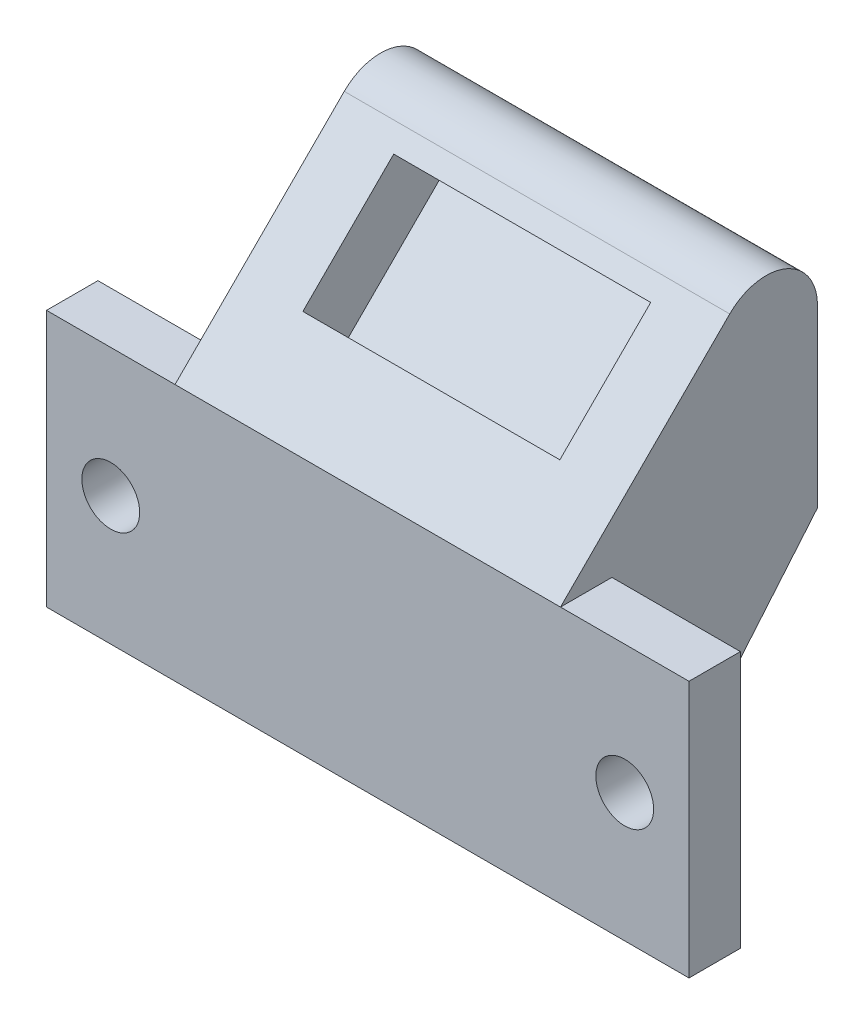
ISO-10303-21;
HEADER;
FILE_DESCRIPTION(('STEP AP214'),'2;1');
FILE_NAME('part.step','',(''),(''),'','','');
FILE_SCHEMA(('AUTOMOTIVE_DESIGN { 1 0 10303 214 1 1 1 1 }'));
ENDSEC;
DATA;
#1=APPLICATION_CONTEXT('core data for automotive mechanical design processes');
#2=APPLICATION_PROTOCOL_DEFINITION('international standard','automotive_design',2000,#1);
#3=PRODUCT_CONTEXT('',#1,'mechanical');
#4=PRODUCT('Part','Part','',(#3));
#5=PRODUCT_RELATED_PRODUCT_CATEGORY('part','',(#4));
#6=PRODUCT_DEFINITION_FORMATION('','',#4);
#7=PRODUCT_DEFINITION_CONTEXT('part definition',#1,'design');
#8=PRODUCT_DEFINITION('design','',#6,#7);
#9=PRODUCT_DEFINITION_SHAPE('','',#8);
#10=(LENGTH_UNIT() NAMED_UNIT(*) SI_UNIT(.MILLI.,.METRE.));
#11=(NAMED_UNIT(*) PLANE_ANGLE_UNIT() SI_UNIT($,.RADIAN.));
#12=(NAMED_UNIT(*) SI_UNIT($,.STERADIAN.) SOLID_ANGLE_UNIT());
#13=UNCERTAINTY_MEASURE_WITH_UNIT(LENGTH_MEASURE(1.E-05),#10,'distance_accuracy_value','');
#14=(GEOMETRIC_REPRESENTATION_CONTEXT(3) GLOBAL_UNCERTAINTY_ASSIGNED_CONTEXT((#13)) GLOBAL_UNIT_ASSIGNED_CONTEXT((#10,
#11,#12)) REPRESENTATION_CONTEXT('',''));
#15=CARTESIAN_POINT('',(0.,0.,0.));
#16=DIRECTION('',(0.,0.,1.));
#17=DIRECTION('',(1.,0.,0.));
#18=AXIS2_PLACEMENT_3D('',#15,#16,#17);
#19=CARTESIAN_POINT('',(30.,0.,0.));
#20=DIRECTION('',(-1.,0.,0.));
#21=DIRECTION('',(0.,0.,1.));
#22=AXIS2_PLACEMENT_3D('',#19,#20,#21);
#23=PLANE('',#22);
#24=DIRECTION('',(0.,0.,-1.));
#25=VECTOR('',#24,1.);
#26=CARTESIAN_POINT('',(30.,0.,0.));
#27=LINE('',#26,#25);
#28=CARTESIAN_POINT('',(30.,0.,-4.));
#29=VERTEX_POINT('',#28);
#30=CARTESIAN_POINT('',(30.,0.,-5.99999999999996));
#31=VERTEX_POINT('',#30);
#32=EDGE_CURVE('E287',#29,#31,#27,.T.);
#33=ORIENTED_EDGE('',*,*,#32,.T.);
#34=DIRECTION('',(0.,-0.766044443118977,0.642787609686541));
#35=VECTOR('',#34,1.);
#36=CARTESIAN_POINT('',(30.,16.6845502963189,-20.));
#37=LINE('',#36,#35);
#38=CARTESIAN_POINT('',(30.,16.6845502963189,-20.));
#39=VERTEX_POINT('',#38);
#40=EDGE_CURVE('E11',#31,#39,#37,.F.);
#41=ORIENTED_EDGE('',*,*,#40,.T.);
#42=DIRECTION('',(0.,1.,0.));
#43=VECTOR('',#42,1.);
#44=CARTESIAN_POINT('',(30.,0.,-20.));
#45=LINE('',#44,#43);
#46=CARTESIAN_POINT('',(30.,30.3431457505077,-20.));
#47=VERTEX_POINT('',#46);
#48=EDGE_CURVE('E290',#39,#47,#45,.T.);
#49=ORIENTED_EDGE('',*,*,#48,.T.);
#50=CARTESIAN_POINT('',(30.,30.3431457505077,-16.));
#51=DIRECTION('',(-1.,0.,0.));
#52=DIRECTION('',(0.,0.,1.));
#53=AXIS2_PLACEMENT_3D('',#50,#51,#52);
#54=CIRCLE('',#53,4.);
#55=CARTESIAN_POINT('',(30.,33.1715728752539,-13.1715728752538));
#56=VERTEX_POINT('',#55);
#57=EDGE_CURVE('E323',#47,#56,#54,.F.);
#58=ORIENTED_EDGE('',*,*,#57,.T.);
#59=DIRECTION('',(0.,-0.707106781186549,0.707106781186546));
#60=VECTOR('',#59,1.);
#61=CARTESIAN_POINT('',(30.,20.,0.));
#62=LINE('',#61,#60);
#63=CARTESIAN_POINT('',(30.,20.,0.));
#64=VERTEX_POINT('',#63);
#65=EDGE_CURVE('E294',#56,#64,#62,.T.);
#66=ORIENTED_EDGE('',*,*,#65,.T.);
#67=DIRECTION('',(0.,0.,1.));
#68=VECTOR('',#67,1.);
#69=CARTESIAN_POINT('',(30.,20.,-4.));
#70=LINE('',#69,#68);
#71=CARTESIAN_POINT('',(30.,20.,-4.));
#72=VERTEX_POINT('',#71);
#73=EDGE_CURVE('E233',#72,#64,#70,.T.);
#74=ORIENTED_EDGE('',*,*,#73,.F.);
#75=DIRECTION('',(0.,-1.,0.));
#76=VECTOR('',#75,1.);
#77=CARTESIAN_POINT('',(30.,0.,-4.));
#78=LINE('',#77,#76);
#79=EDGE_CURVE('E209',#72,#29,#78,.T.);
#80=ORIENTED_EDGE('',*,*,#79,.T.);
#81=EDGE_LOOP('',(#33,#41,#49,#58,#66,#74,#80));
#82=FACE_BOUND('',#81,.T.);
#83=ADVANCED_FACE('F38',(#82),#23,.F.);
#84=CARTESIAN_POINT('',(0.,0.,0.));
#85=DIRECTION('',(-1.,0.,0.));
#86=DIRECTION('',(0.,0.,1.));
#87=AXIS2_PLACEMENT_3D('',#84,#85,#86);
#88=PLANE('',#87);
#89=DIRECTION('',(0.,1.,0.));
#90=VECTOR('',#89,1.);
#91=CARTESIAN_POINT('',(0.,40.0000000000001,-20.));
#92=LINE('',#91,#90);
#93=CARTESIAN_POINT('',(0.,16.6845502963189,-20.));
#94=VERTEX_POINT('',#93);
#95=CARTESIAN_POINT('',(0.,30.3431457505077,-20.));
#96=VERTEX_POINT('',#95);
#97=EDGE_CURVE('E300',#94,#96,#92,.T.);
#98=ORIENTED_EDGE('',*,*,#97,.F.);
#99=DIRECTION('',(0.,0.766044443118977,-0.642787609686541));
#100=VECTOR('',#99,1.);
#101=CARTESIAN_POINT('',(0.,-2.95442325903661,-3.52094453300076));
#102=LINE('',#101,#100);
#103=CARTESIAN_POINT('',(0.,0.,-5.99999999999996));
#104=VERTEX_POINT('',#103);
#105=EDGE_CURVE('E61',#94,#104,#102,.F.);
#106=ORIENTED_EDGE('',*,*,#105,.T.);
#107=DIRECTION('',(0.,0.,-1.));
#108=VECTOR('',#107,1.);
#109=CARTESIAN_POINT('',(0.,0.,0.));
#110=LINE('',#109,#108);
#111=CARTESIAN_POINT('',(0.,0.,-4.));
#112=VERTEX_POINT('',#111);
#113=EDGE_CURVE('E280',#112,#104,#110,.T.);
#114=ORIENTED_EDGE('',*,*,#113,.F.);
#115=DIRECTION('',(0.,1.,0.));
#116=VECTOR('',#115,1.);
#117=CARTESIAN_POINT('',(0.,20.,-4.));
#118=LINE('',#117,#116);
#119=CARTESIAN_POINT('',(0.,20.,-4.));
#120=VERTEX_POINT('',#119);
#121=EDGE_CURVE('E252',#112,#120,#118,.T.);
#122=ORIENTED_EDGE('',*,*,#121,.T.);
#123=DIRECTION('',(0.,0.,1.));
#124=VECTOR('',#123,1.);
#125=CARTESIAN_POINT('',(0.,20.,-4.));
#126=LINE('',#125,#124);
#127=CARTESIAN_POINT('',(0.,20.,0.));
#128=VERTEX_POINT('',#127);
#129=EDGE_CURVE('E269',#120,#128,#126,.T.);
#130=ORIENTED_EDGE('',*,*,#129,.T.);
#131=DIRECTION('',(0.,-0.707106781186549,0.707106781186546));
#132=VECTOR('',#131,1.);
#133=CARTESIAN_POINT('',(0.,20.,0.));
#134=LINE('',#133,#132);
#135=CARTESIAN_POINT('',(0.,33.1715728752539,-13.1715728752538));
#136=VERTEX_POINT('',#135);
#137=EDGE_CURVE('E291',#136,#128,#134,.T.);
#138=ORIENTED_EDGE('',*,*,#137,.F.);
#139=CARTESIAN_POINT('',(0.,30.3431457505077,-16.));
#140=DIRECTION('',(-1.,0.,0.));
#141=DIRECTION('',(0.,0.,1.));
#142=AXIS2_PLACEMENT_3D('',#139,#140,#141);
#143=CIRCLE('',#142,4.);
#144=EDGE_CURVE('E315',#136,#96,#143,.T.);
#145=ORIENTED_EDGE('',*,*,#144,.T.);
#146=EDGE_LOOP('',(#98,#106,#114,#122,#130,#138,#145));
#147=FACE_BOUND('',#146,.T.);
#148=ADVANCED_FACE('F338',(#147),#88,.T.);
#149=CARTESIAN_POINT('',(30.,0.,0.));
#150=DIRECTION('',(0.,0.,-1.));
#151=DIRECTION('',(-1.,0.,0.));
#152=AXIS2_PLACEMENT_3D('',#149,#150,#151);
#153=PLANE('',#152);
#154=DIRECTION('',(-1.,0.,0.));
#155=VECTOR('',#154,1.);
#156=CARTESIAN_POINT('',(30.,20.,0.));
#157=LINE('',#156,#155);
#158=EDGE_CURVE('E297',#64,#128,#157,.T.);
#159=ORIENTED_EDGE('',*,*,#158,.T.);
#160=DIRECTION('',(-1.,0.,0.));
#161=VECTOR('',#160,1.);
#162=CARTESIAN_POINT('',(0.,20.,0.));
#163=LINE('',#162,#161);
#164=CARTESIAN_POINT('',(-10.,20.,0.));
#165=VERTEX_POINT('',#164);
#166=EDGE_CURVE('E248',#128,#165,#163,.T.);
#167=ORIENTED_EDGE('',*,*,#166,.T.);
#168=DIRECTION('',(0.,-1.,0.));
#169=VECTOR('',#168,1.);
#170=CARTESIAN_POINT('',(-10.,20.,0.));
#171=LINE('',#170,#169);
#172=CARTESIAN_POINT('',(-10.,0.,0.));
#173=VERTEX_POINT('',#172);
#174=EDGE_CURVE('E257',#165,#173,#171,.T.);
#175=ORIENTED_EDGE('',*,*,#174,.T.);
#176=DIRECTION('',(-1.,0.,0.));
#177=VECTOR('',#176,1.);
#178=CARTESIAN_POINT('',(30.,0.,0.));
#179=LINE('',#178,#177);
#180=CARTESIAN_POINT('',(40.,0.,0.));
#181=VERTEX_POINT('',#180);
#182=EDGE_CURVE('E308',#181,#173,#179,.T.);
#183=ORIENTED_EDGE('',*,*,#182,.F.);
#184=DIRECTION('',(0.,1.,0.));
#185=VECTOR('',#184,1.);
#186=CARTESIAN_POINT('',(40.,0.,0.));
#187=LINE('',#186,#185);
#188=CARTESIAN_POINT('',(40.,20.,0.));
#189=VERTEX_POINT('',#188);
#190=EDGE_CURVE('E205',#181,#189,#187,.T.);
#191=ORIENTED_EDGE('',*,*,#190,.T.);
#192=DIRECTION('',(-1.,0.,0.));
#193=VECTOR('',#192,1.);
#194=CARTESIAN_POINT('',(30.,20.,0.));
#195=LINE('',#194,#193);
#196=EDGE_CURVE('E214',#189,#64,#195,.T.);
#197=ORIENTED_EDGE('',*,*,#196,.T.);
#198=EDGE_LOOP('',(#159,#167,#175,#183,#191,#197));
#199=FACE_BOUND('',#198,.T.);
#200=CARTESIAN_POINT('',(-5.,10.,0.));
#201=DIRECTION('',(0.,0.,1.));
#202=DIRECTION('',(1.,0.,0.));
#203=AXIS2_PLACEMENT_3D('',#200,#201,#202);
#204=CIRCLE('',#203,2.25);
#205=CARTESIAN_POINT('',(-2.75,10.,0.));
#206=VERTEX_POINT('',#205);
#207=EDGE_CURVE('E237',#206,#206,#204,.T.);
#208=ORIENTED_EDGE('',*,*,#207,.F.);
#209=EDGE_LOOP('',(#208));
#210=FACE_BOUND('',#209,.T.);
#211=CARTESIAN_POINT('',(35.,10.,0.));
#212=DIRECTION('',(0.,0.,1.));
#213=DIRECTION('',(1.,0.,0.));
#214=AXIS2_PLACEMENT_3D('',#211,#212,#213);
#215=CIRCLE('',#214,2.25);
#216=CARTESIAN_POINT('',(37.25,10.,0.));
#217=VERTEX_POINT('',#216);
#218=EDGE_CURVE('E195',#217,#217,#215,.T.);
#219=ORIENTED_EDGE('',*,*,#218,.F.);
#220=EDGE_LOOP('',(#219));
#221=FACE_BOUND('',#220,.T.);
#222=ADVANCED_FACE('F353',(#199,#210,#221),#153,.F.);
#223=CARTESIAN_POINT('',(30.,0.,0.));
#224=DIRECTION('',(0.,1.,0.));
#225=DIRECTION('',(0.,0.,1.));
#226=AXIS2_PLACEMENT_3D('',#223,#224,#225);
#227=PLANE('',#226);
#228=ORIENTED_EDGE('',*,*,#113,.T.);
#229=DIRECTION('',(1.,0.,0.));
#230=VECTOR('',#229,1.);
#231=CARTESIAN_POINT('',(30.,0.,-5.99999999999996));
#232=LINE('',#231,#230);
#233=EDGE_CURVE('E47',#104,#31,#232,.T.);
#234=ORIENTED_EDGE('',*,*,#233,.T.);
#235=ORIENTED_EDGE('',*,*,#32,.F.);
#236=DIRECTION('',(1.,0.,0.));
#237=VECTOR('',#236,1.);
#238=CARTESIAN_POINT('',(30.,0.,-4.));
#239=LINE('',#238,#237);
#240=CARTESIAN_POINT('',(40.,0.,-4.));
#241=VERTEX_POINT('',#240);
#242=EDGE_CURVE('E213',#29,#241,#239,.T.);
#243=ORIENTED_EDGE('',*,*,#242,.T.);
#244=DIRECTION('',(0.,0.,1.));
#245=VECTOR('',#244,1.);
#246=CARTESIAN_POINT('',(40.,0.,-4.));
#247=LINE('',#246,#245);
#248=EDGE_CURVE('E226',#241,#181,#247,.T.);
#249=ORIENTED_EDGE('',*,*,#248,.T.);
#250=ORIENTED_EDGE('',*,*,#182,.T.);
#251=DIRECTION('',(0.,0.,1.));
#252=VECTOR('',#251,1.);
#253=CARTESIAN_POINT('',(-10.,0.,-4.));
#254=LINE('',#253,#252);
#255=CARTESIAN_POINT('',(-10.,0.,-4.));
#256=VERTEX_POINT('',#255);
#257=EDGE_CURVE('E276',#256,#173,#254,.T.);
#258=ORIENTED_EDGE('',*,*,#257,.F.);
#259=DIRECTION('',(1.,0.,0.));
#260=VECTOR('',#259,1.);
#261=CARTESIAN_POINT('',(0.,0.,-4.));
#262=LINE('',#261,#260);
#263=EDGE_CURVE('E265',#256,#112,#262,.T.);
#264=ORIENTED_EDGE('',*,*,#263,.T.);
#265=EDGE_LOOP('',(#228,#234,#235,#243,#249,#250,#258,#264));
#266=FACE_BOUND('',#265,.T.);
#267=ADVANCED_FACE('F361',(#266),#227,.F.);
#268=CARTESIAN_POINT('',(30.,40.0000000000001,-20.));
#269=DIRECTION('',(0.,0.,1.));
#270=DIRECTION('',(1.,0.,0.));
#271=AXIS2_PLACEMENT_3D('',#268,#269,#270);
#272=PLANE('',#271);
#273=ORIENTED_EDGE('',*,*,#48,.F.);
#274=DIRECTION('',(-1.,0.,0.));
#275=VECTOR('',#274,1.);
#276=CARTESIAN_POINT('',(30.,16.6845502963189,-20.));
#277=LINE('',#276,#275);
#278=EDGE_CURVE('E326',#39,#94,#277,.T.);
#279=ORIENTED_EDGE('',*,*,#278,.T.);
#280=ORIENTED_EDGE('',*,*,#97,.T.);
#281=DIRECTION('',(-1.,0.,0.));
#282=VECTOR('',#281,1.);
#283=CARTESIAN_POINT('',(30.,30.3431457505077,-20.));
#284=LINE('',#283,#282);
#285=EDGE_CURVE('E319',#96,#47,#284,.F.);
#286=ORIENTED_EDGE('',*,*,#285,.T.);
#287=EDGE_LOOP('',(#273,#279,#280,#286));
#288=FACE_BOUND('',#287,.T.);
#289=ADVANCED_FACE('F335',(#288),#272,.F.);
#290=CARTESIAN_POINT('',(30.,20.,0.));
#291=DIRECTION('',(0.,-0.707106781186546,-0.707106781186549));
#292=DIRECTION('',(0.,0.707106781186549,-0.707106781186546));
#293=AXIS2_PLACEMENT_3D('',#290,#291,#292);
#294=PLANE('',#293);
#295=DIRECTION('',(1.,0.,0.));
#296=VECTOR('',#295,1.);
#297=CARTESIAN_POINT('',(5.,24.9497474683058,-4.94974746830582));
#298=LINE('',#297,#296);
#299=CARTESIAN_POINT('',(5.,24.9497474683058,-4.94974746830582));
#300=VERTEX_POINT('',#299);
#301=CARTESIAN_POINT('',(25.,24.9497474683058,-4.94974746830582));
#302=VERTEX_POINT('',#301);
#303=EDGE_CURVE('E186',#300,#302,#298,.T.);
#304=ORIENTED_EDGE('',*,*,#303,.F.);
#305=DIRECTION('',(0.,-0.707106781186549,0.707106781186546));
#306=VECTOR('',#305,1.);
#307=CARTESIAN_POINT('',(5.,24.9497474683058,-4.94974746830582));
#308=LINE('',#307,#306);
#309=CARTESIAN_POINT('',(5.,32.0208152801713,-12.0208152801713));
#310=VERTEX_POINT('',#309);
#311=EDGE_CURVE('E153',#310,#300,#308,.T.);
#312=ORIENTED_EDGE('',*,*,#311,.F.);
#313=DIRECTION('',(-1.,0.,0.));
#314=VECTOR('',#313,1.);
#315=CARTESIAN_POINT('',(5.,32.0208152801713,-12.0208152801713));
#316=LINE('',#315,#314);
#317=CARTESIAN_POINT('',(25.,32.0208152801713,-12.0208152801713));
#318=VERTEX_POINT('',#317);
#319=EDGE_CURVE('E173',#318,#310,#316,.T.);
#320=ORIENTED_EDGE('',*,*,#319,.F.);
#321=DIRECTION('',(0.,0.707106781186549,-0.707106781186546));
#322=VECTOR('',#321,1.);
#323=CARTESIAN_POINT('',(25.,24.9497474683058,-4.94974746830582));
#324=LINE('',#323,#322);
#325=EDGE_CURVE('E177',#302,#318,#324,.T.);
#326=ORIENTED_EDGE('',*,*,#325,.F.);
#327=EDGE_LOOP('',(#304,#312,#320,#326));
#328=FACE_BOUND('',#327,.T.);
#329=ORIENTED_EDGE('',*,*,#65,.F.);
#330=DIRECTION('',(-1.,0.,0.));
#331=VECTOR('',#330,1.);
#332=CARTESIAN_POINT('',(30.,33.1715728752539,-13.1715728752538));
#333=LINE('',#332,#331);
#334=EDGE_CURVE('E311',#56,#136,#333,.T.);
#335=ORIENTED_EDGE('',*,*,#334,.T.);
#336=ORIENTED_EDGE('',*,*,#137,.T.);
#337=ORIENTED_EDGE('',*,*,#158,.F.);
#338=EDGE_LOOP('',(#329,#335,#336,#337));
#339=FACE_BOUND('',#338,.T.);
#340=ADVANCED_FACE('F350',(#328,#339),#294,.F.);
#341=CARTESIAN_POINT('',(-10.,20.,-4.));
#342=DIRECTION('',(-1.,0.,0.));
#343=DIRECTION('',(0.,-1.,0.));
#344=AXIS2_PLACEMENT_3D('',#341,#342,#343);
#345=PLANE('',#344);
#346=ORIENTED_EDGE('',*,*,#174,.F.);
#347=DIRECTION('',(0.,0.,1.));
#348=VECTOR('',#347,1.);
#349=CARTESIAN_POINT('',(-10.,20.,-4.));
#350=LINE('',#349,#348);
#351=CARTESIAN_POINT('',(-10.,20.,-4.));
#352=VERTEX_POINT('',#351);
#353=EDGE_CURVE('E281',#352,#165,#350,.T.);
#354=ORIENTED_EDGE('',*,*,#353,.F.);
#355=DIRECTION('',(0.,-1.,0.));
#356=VECTOR('',#355,1.);
#357=CARTESIAN_POINT('',(-10.,20.,-4.));
#358=LINE('',#357,#356);
#359=EDGE_CURVE('E261',#352,#256,#358,.T.);
#360=ORIENTED_EDGE('',*,*,#359,.T.);
#361=ORIENTED_EDGE('',*,*,#257,.T.);
#362=EDGE_LOOP('',(#346,#354,#360,#361));
#363=FACE_BOUND('',#362,.T.);
#364=ADVANCED_FACE('F391',(#363),#345,.T.);
#365=CARTESIAN_POINT('',(0.,20.,-4.));
#366=DIRECTION('',(0.,1.,0.));
#367=DIRECTION('',(0.,0.,1.));
#368=AXIS2_PLACEMENT_3D('',#365,#366,#367);
#369=PLANE('',#368);
#370=ORIENTED_EDGE('',*,*,#166,.F.);
#371=ORIENTED_EDGE('',*,*,#129,.F.);
#372=DIRECTION('',(-1.,0.,0.));
#373=VECTOR('',#372,1.);
#374=CARTESIAN_POINT('',(0.,20.,-4.));
#375=LINE('',#374,#373);
#376=EDGE_CURVE('E256',#120,#352,#375,.T.);
#377=ORIENTED_EDGE('',*,*,#376,.T.);
#378=ORIENTED_EDGE('',*,*,#353,.T.);
#379=EDGE_LOOP('',(#370,#371,#377,#378));
#380=FACE_BOUND('',#379,.T.);
#381=ADVANCED_FACE('F386',(#380),#369,.T.);
#382=CARTESIAN_POINT('',(0.,0.,-4.));
#383=DIRECTION('',(0.,0.,-1.));
#384=DIRECTION('',(-1.,0.,0.));
#385=AXIS2_PLACEMENT_3D('',#382,#383,#384);
#386=PLANE('',#385);
#387=CARTESIAN_POINT('',(-5.,10.,-4.));
#388=DIRECTION('',(0.,0.,1.));
#389=DIRECTION('',(1.,0.,0.));
#390=AXIS2_PLACEMENT_3D('',#387,#388,#389);
#391=CIRCLE('',#390,2.25);
#392=CARTESIAN_POINT('',(-2.75,10.,-4.));
#393=VERTEX_POINT('',#392);
#394=EDGE_CURVE('E244',#393,#393,#391,.T.);
#395=ORIENTED_EDGE('',*,*,#394,.T.);
#396=EDGE_LOOP('',(#395));
#397=FACE_BOUND('',#396,.T.);
#398=ORIENTED_EDGE('',*,*,#121,.F.);
#399=ORIENTED_EDGE('',*,*,#263,.F.);
#400=ORIENTED_EDGE('',*,*,#359,.F.);
#401=ORIENTED_EDGE('',*,*,#376,.F.);
#402=EDGE_LOOP('',(#398,#399,#400,#401));
#403=FACE_BOUND('',#402,.T.);
#404=ADVANCED_FACE('F503',(#397,#403),#386,.T.);
#405=CARTESIAN_POINT('',(-5.,10.,-4.));
#406=DIRECTION('',(0.,0.,1.));
#407=DIRECTION('',(1.,0.,0.));
#408=AXIS2_PLACEMENT_3D('',#405,#406,#407);
#409=CYLINDRICAL_SURFACE('',#408,2.25);
#410=ORIENTED_EDGE('',*,*,#394,.F.);
#411=EDGE_LOOP('',(#410));
#412=FACE_BOUND('',#411,.T.);
#413=ORIENTED_EDGE('',*,*,#207,.T.);
#414=EDGE_LOOP('',(#413));
#415=FACE_BOUND('',#414,.T.);
#416=ADVANCED_FACE('F375',(#412,#415),#409,.F.);
#417=CARTESIAN_POINT('',(30.,20.,-4.));
#418=DIRECTION('',(0.,1.,0.));
#419=DIRECTION('',(0.,0.,1.));
#420=AXIS2_PLACEMENT_3D('',#417,#418,#419);
#421=PLANE('',#420);
#422=ORIENTED_EDGE('',*,*,#196,.F.);
#423=DIRECTION('',(0.,0.,1.));
#424=VECTOR('',#423,1.);
#425=CARTESIAN_POINT('',(40.,20.,-4.));
#426=LINE('',#425,#424);
#427=CARTESIAN_POINT('',(40.,20.,-4.));
#428=VERTEX_POINT('',#427);
#429=EDGE_CURVE('E238',#428,#189,#426,.T.);
#430=ORIENTED_EDGE('',*,*,#429,.F.);
#431=DIRECTION('',(-1.,0.,0.));
#432=VECTOR('',#431,1.);
#433=CARTESIAN_POINT('',(30.,20.,-4.));
#434=LINE('',#433,#432);
#435=EDGE_CURVE('E222',#428,#72,#434,.T.);
#436=ORIENTED_EDGE('',*,*,#435,.T.);
#437=ORIENTED_EDGE('',*,*,#73,.T.);
#438=EDGE_LOOP('',(#422,#430,#436,#437));
#439=FACE_BOUND('',#438,.T.);
#440=ADVANCED_FACE('F358',(#439),#421,.T.);
#441=CARTESIAN_POINT('',(40.,0.,-4.));
#442=DIRECTION('',(1.,0.,0.));
#443=DIRECTION('',(0.,0.,-1.));
#444=AXIS2_PLACEMENT_3D('',#441,#442,#443);
#445=PLANE('',#444);
#446=ORIENTED_EDGE('',*,*,#190,.F.);
#447=ORIENTED_EDGE('',*,*,#248,.F.);
#448=DIRECTION('',(0.,1.,0.));
#449=VECTOR('',#448,1.);
#450=CARTESIAN_POINT('',(40.,0.,-4.));
#451=LINE('',#450,#449);
#452=EDGE_CURVE('E218',#241,#428,#451,.T.);
#453=ORIENTED_EDGE('',*,*,#452,.T.);
#454=ORIENTED_EDGE('',*,*,#429,.T.);
#455=EDGE_LOOP('',(#446,#447,#453,#454));
#456=FACE_BOUND('',#455,.T.);
#457=ADVANCED_FACE('F365',(#456),#445,.T.);
#458=CARTESIAN_POINT('',(0.,0.,-4.));
#459=DIRECTION('',(0.,0.,-1.));
#460=DIRECTION('',(-1.,0.,0.));
#461=AXIS2_PLACEMENT_3D('',#458,#459,#460);
#462=PLANE('',#461);
#463=CARTESIAN_POINT('',(35.,10.,-4.));
#464=DIRECTION('',(0.,0.,1.));
#465=DIRECTION('',(1.,0.,0.));
#466=AXIS2_PLACEMENT_3D('',#463,#464,#465);
#467=CIRCLE('',#466,2.25);
#468=CARTESIAN_POINT('',(37.25,10.,-4.));
#469=VERTEX_POINT('',#468);
#470=EDGE_CURVE('E201',#469,#469,#467,.T.);
#471=ORIENTED_EDGE('',*,*,#470,.T.);
#472=EDGE_LOOP('',(#471));
#473=FACE_BOUND('',#472,.T.);
#474=ORIENTED_EDGE('',*,*,#79,.F.);
#475=ORIENTED_EDGE('',*,*,#435,.F.);
#476=ORIENTED_EDGE('',*,*,#452,.F.);
#477=ORIENTED_EDGE('',*,*,#242,.F.);
#478=EDGE_LOOP('',(#474,#475,#476,#477));
#479=FACE_BOUND('',#478,.T.);
#480=ADVANCED_FACE('F363',(#473,#479),#462,.T.);
#481=CARTESIAN_POINT('',(35.,10.,-4.));
#482=DIRECTION('',(0.,0.,1.));
#483=DIRECTION('',(1.,0.,0.));
#484=AXIS2_PLACEMENT_3D('',#481,#482,#483);
#485=CYLINDRICAL_SURFACE('',#484,2.25);
#486=ORIENTED_EDGE('',*,*,#470,.F.);
#487=EDGE_LOOP('',(#486));
#488=FACE_BOUND('',#487,.T.);
#489=ORIENTED_EDGE('',*,*,#218,.T.);
#490=EDGE_LOOP('',(#489));
#491=FACE_BOUND('',#490,.T.);
#492=ADVANCED_FACE('F372',(#488,#491),#485,.F.);
#493=CARTESIAN_POINT('',(5.,21.4142135623731,-8.48528137423857));
#494=DIRECTION('',(-1.,0.,0.));
#495=DIRECTION('',(0.,0.,1.));
#496=AXIS2_PLACEMENT_3D('',#493,#494,#495);
#497=PLANE('',#496);
#498=ORIENTED_EDGE('',*,*,#311,.T.);
#499=DIRECTION('',(0.,0.707106781186546,0.707106781186549));
#500=VECTOR('',#499,1.);
#501=CARTESIAN_POINT('',(5.,21.4142135623731,-8.48528137423857));
#502=LINE('',#501,#500);
#503=CARTESIAN_POINT('',(5.,21.4142135623731,-8.48528137423857));
#504=VERTEX_POINT('',#503);
#505=EDGE_CURVE('E146',#504,#300,#502,.T.);
#506=ORIENTED_EDGE('',*,*,#505,.F.);
#507=DIRECTION('',(0.,-0.707106781186549,0.707106781186546));
#508=VECTOR('',#507,1.);
#509=CARTESIAN_POINT('',(5.,21.4142135623731,-8.48528137423857));
#510=LINE('',#509,#508);
#511=CARTESIAN_POINT('',(5.,28.4852813742386,-15.556349186104));
#512=VERTEX_POINT('',#511);
#513=EDGE_CURVE('E150',#512,#504,#510,.T.);
#514=ORIENTED_EDGE('',*,*,#513,.F.);
#515=DIRECTION('',(0.,0.707106781186546,0.707106781186549));
#516=VECTOR('',#515,1.);
#517=CARTESIAN_POINT('',(5.,28.4852813742386,-15.556349186104));
#518=LINE('',#517,#516);
#519=EDGE_CURVE('E192',#512,#310,#518,.T.);
#520=ORIENTED_EDGE('',*,*,#519,.T.);
#521=EDGE_LOOP('',(#498,#506,#514,#520));
#522=FACE_BOUND('',#521,.T.);
#523=ADVANCED_FACE('F148',(#522),#497,.F.);
#524=CARTESIAN_POINT('',(5.,28.4852813742386,-15.556349186104));
#525=DIRECTION('',(0.,0.707106781186549,-0.707106781186546));
#526=DIRECTION('',(0.,0.707106781186546,0.707106781186549));
#527=AXIS2_PLACEMENT_3D('',#524,#525,#526);
#528=PLANE('',#527);
#529=ORIENTED_EDGE('',*,*,#319,.T.);
#530=ORIENTED_EDGE('',*,*,#519,.F.);
#531=DIRECTION('',(-1.,0.,0.));
#532=VECTOR('',#531,1.);
#533=CARTESIAN_POINT('',(5.,28.4852813742386,-15.556349186104));
#534=LINE('',#533,#532);
#535=CARTESIAN_POINT('',(25.,28.4852813742386,-15.556349186104));
#536=VERTEX_POINT('',#535);
#537=EDGE_CURVE('E159',#536,#512,#534,.T.);
#538=ORIENTED_EDGE('',*,*,#537,.F.);
#539=DIRECTION('',(0.,0.707106781186546,0.707106781186549));
#540=VECTOR('',#539,1.);
#541=CARTESIAN_POINT('',(25.,28.4852813742386,-15.556349186104));
#542=LINE('',#541,#540);
#543=EDGE_CURVE('E196',#536,#318,#542,.T.);
#544=ORIENTED_EDGE('',*,*,#543,.T.);
#545=EDGE_LOOP('',(#529,#530,#538,#544));
#546=FACE_BOUND('',#545,.T.);
#547=ADVANCED_FACE('F409',(#546),#528,.F.);
#548=CARTESIAN_POINT('',(25.,21.4142135623731,-8.48528137423857));
#549=DIRECTION('',(1.,0.,0.));
#550=DIRECTION('',(0.,0.,-1.));
#551=AXIS2_PLACEMENT_3D('',#548,#549,#550);
#552=PLANE('',#551);
#553=ORIENTED_EDGE('',*,*,#325,.T.);
#554=ORIENTED_EDGE('',*,*,#543,.F.);
#555=DIRECTION('',(0.,0.707106781186549,-0.707106781186546));
#556=VECTOR('',#555,1.);
#557=CARTESIAN_POINT('',(25.,21.4142135623731,-8.48528137423857));
#558=LINE('',#557,#556);
#559=CARTESIAN_POINT('',(25.,21.4142135623731,-8.48528137423857));
#560=VERTEX_POINT('',#559);
#561=EDGE_CURVE('E168',#560,#536,#558,.T.);
#562=ORIENTED_EDGE('',*,*,#561,.F.);
#563=DIRECTION('',(0.,0.707106781186546,0.707106781186549));
#564=VECTOR('',#563,1.);
#565=CARTESIAN_POINT('',(25.,21.4142135623731,-8.48528137423857));
#566=LINE('',#565,#564);
#567=EDGE_CURVE('E158',#560,#302,#566,.T.);
#568=ORIENTED_EDGE('',*,*,#567,.T.);
#569=EDGE_LOOP('',(#553,#554,#562,#568));
#570=FACE_BOUND('',#569,.T.);
#571=ADVANCED_FACE('F406',(#570),#552,.F.);
#572=CARTESIAN_POINT('',(5.,21.4142135623731,-8.48528137423857));
#573=DIRECTION('',(0.,-0.707106781186549,0.707106781186546));
#574=DIRECTION('',(0.,-0.707106781186546,-0.707106781186549));
#575=AXIS2_PLACEMENT_3D('',#572,#573,#574);
#576=PLANE('',#575);
#577=ORIENTED_EDGE('',*,*,#303,.T.);
#578=ORIENTED_EDGE('',*,*,#567,.F.);
#579=DIRECTION('',(1.,0.,0.));
#580=VECTOR('',#579,1.);
#581=CARTESIAN_POINT('',(5.,21.4142135623731,-8.48528137423857));
#582=LINE('',#581,#580);
#583=EDGE_CURVE('E162',#504,#560,#582,.T.);
#584=ORIENTED_EDGE('',*,*,#583,.F.);
#585=ORIENTED_EDGE('',*,*,#505,.T.);
#586=EDGE_LOOP('',(#577,#578,#584,#585));
#587=FACE_BOUND('',#586,.T.);
#588=ADVANCED_FACE('F163',(#587),#576,.F.);
#589=CARTESIAN_POINT('',(0.,6.46446609406723,6.46446609406725));
#590=DIRECTION('',(0.,-0.707106781186546,-0.707106781186549));
#591=DIRECTION('',(0.,0.707106781186549,-0.707106781186546));
#592=AXIS2_PLACEMENT_3D('',#589,#590,#591);
#593=PLANE('',#592);
#594=ORIENTED_EDGE('',*,*,#513,.T.);
#595=ORIENTED_EDGE('',*,*,#583,.T.);
#596=ORIENTED_EDGE('',*,*,#561,.T.);
#597=ORIENTED_EDGE('',*,*,#537,.T.);
#598=EDGE_LOOP('',(#594,#595,#596,#597));
#599=FACE_BOUND('',#598,.T.);
#600=ADVANCED_FACE('F170',(#599),#593,.F.);
#601=CARTESIAN_POINT('',(30.,30.3431457505077,-16.));
#602=DIRECTION('',(-1.,0.,0.));
#603=DIRECTION('',(0.,0.,1.));
#604=AXIS2_PLACEMENT_3D('',#601,#602,#603);
#605=CYLINDRICAL_SURFACE('',#604,4.);
#606=ORIENTED_EDGE('',*,*,#57,.F.);
#607=ORIENTED_EDGE('',*,*,#285,.F.);
#608=ORIENTED_EDGE('',*,*,#144,.F.);
#609=ORIENTED_EDGE('',*,*,#334,.F.);
#610=EDGE_LOOP('',(#606,#607,#608,#609));
#611=FACE_BOUND('',#610,.T.);
#612=ADVANCED_FACE('F344',(#611),#605,.T.);
#613=CARTESIAN_POINT('',(30.,16.6845502963189,-20.));
#614=DIRECTION('',(0.,0.642787609686541,0.766044443118977));
#615=DIRECTION('',(-1.,0.,0.));
#616=AXIS2_PLACEMENT_3D('',#613,#614,#615);
#617=PLANE('',#616);
#618=ORIENTED_EDGE('',*,*,#40,.F.);
#619=ORIENTED_EDGE('',*,*,#233,.F.);
#620=ORIENTED_EDGE('',*,*,#105,.F.);
#621=ORIENTED_EDGE('',*,*,#278,.F.);
#622=EDGE_LOOP('',(#618,#619,#620,#621));
#623=FACE_BOUND('',#622,.T.);
#624=ADVANCED_FACE('F40',(#623),#617,.F.);
#625=CLOSED_SHELL('',(#83,#148,#222,#267,#289,#340,#364,#381,#404,#416,#440,#457,#480,#492,#523,
#547,#571,#588,#600,#612,#624));
#626=MANIFOLD_SOLID_BREP('B2',#625);
#627=ADVANCED_BREP_SHAPE_REPRESENTATION('',(#18,#626),#14);
#628=SHAPE_DEFINITION_REPRESENTATION(#9,#627);
ENDSEC;
END-ISO-10303-21;
